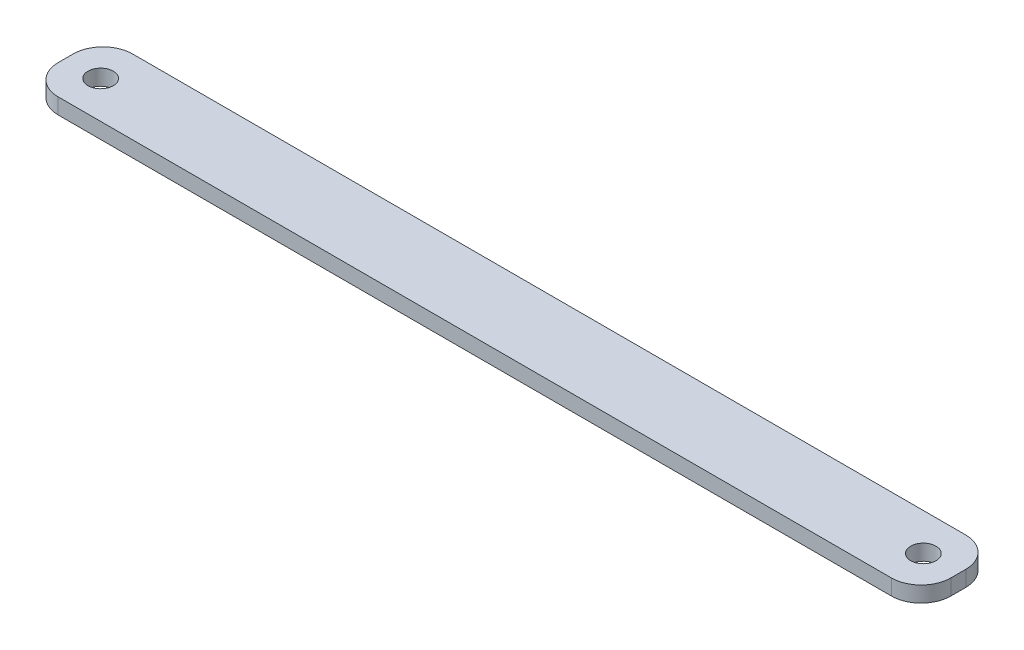
ISO-10303-21;
HEADER;
FILE_DESCRIPTION(('STEP AP214'),'2;1');
FILE_NAME('part.step','',(''),(''),'','','');
FILE_SCHEMA(('AUTOMOTIVE_DESIGN { 1 0 10303 214 1 1 1 1 }'));
ENDSEC;
DATA;
#1=APPLICATION_CONTEXT('core data for automotive mechanical design processes');
#2=APPLICATION_PROTOCOL_DEFINITION('international standard','automotive_design',2000,#1);
#3=PRODUCT_CONTEXT('',#1,'mechanical');
#4=PRODUCT('Part','Part','',(#3));
#5=PRODUCT_RELATED_PRODUCT_CATEGORY('part','',(#4));
#6=PRODUCT_DEFINITION_FORMATION('','',#4);
#7=PRODUCT_DEFINITION_CONTEXT('part definition',#1,'design');
#8=PRODUCT_DEFINITION('design','',#6,#7);
#9=PRODUCT_DEFINITION_SHAPE('','',#8);
#10=(LENGTH_UNIT() NAMED_UNIT(*) SI_UNIT(.MILLI.,.METRE.));
#11=(NAMED_UNIT(*) PLANE_ANGLE_UNIT() SI_UNIT($,.RADIAN.));
#12=(NAMED_UNIT(*) SI_UNIT($,.STERADIAN.) SOLID_ANGLE_UNIT());
#13=UNCERTAINTY_MEASURE_WITH_UNIT(LENGTH_MEASURE(1.E-05),#10,'distance_accuracy_value','');
#14=(GEOMETRIC_REPRESENTATION_CONTEXT(3) GLOBAL_UNCERTAINTY_ASSIGNED_CONTEXT((#13)) GLOBAL_UNIT_ASSIGNED_CONTEXT((#10,
#11,#12)) REPRESENTATION_CONTEXT('',''));
#15=CARTESIAN_POINT('',(0.,0.,0.));
#16=DIRECTION('',(0.,0.,1.));
#17=DIRECTION('',(1.,0.,0.));
#18=AXIS2_PLACEMENT_3D('',#15,#16,#17);
#19=CARTESIAN_POINT('',(0.,2.11,0.));
#20=DIRECTION('',(0.,1.,0.));
#21=DIRECTION('',(0.,0.,1.));
#22=AXIS2_PLACEMENT_3D('',#19,#20,#21);
#23=PLANE('',#22);
#24=CARTESIAN_POINT('',(-55.3,2.11,0.));
#25=DIRECTION('',(0.,1.,0.));
#26=DIRECTION('',(0.,0.,1.));
#27=AXIS2_PLACEMENT_3D('',#24,#25,#26);
#28=CIRCLE('',#27,1.7);
#29=CARTESIAN_POINT('',(-55.3,2.11,1.7));
#30=VERTEX_POINT('',#29);
#31=EDGE_CURVE('E133',#30,#30,#28,.T.);
#32=ORIENTED_EDGE('',*,*,#31,.F.);
#33=EDGE_LOOP('',(#32));
#34=FACE_BOUND('',#33,.T.);
#35=DIRECTION('',(0.,0.,-1.));
#36=VECTOR('',#35,1.);
#37=CARTESIAN_POINT('',(60.,2.11,-5.));
#38=LINE('',#37,#36);
#39=CARTESIAN_POINT('',(60.,2.11,1.));
#40=VERTEX_POINT('',#39);
#41=CARTESIAN_POINT('',(60.,2.11,-0.999999999999997));
#42=VERTEX_POINT('',#41);
#43=EDGE_CURVE('E138',#40,#42,#38,.T.);
#44=ORIENTED_EDGE('',*,*,#43,.T.);
#45=CARTESIAN_POINT('',(56.,2.11,-0.999999999999997));
#46=DIRECTION('',(0.,1.,0.));
#47=DIRECTION('',(0.,0.,1.));
#48=AXIS2_PLACEMENT_3D('',#45,#46,#47);
#49=CIRCLE('',#48,4.);
#50=CARTESIAN_POINT('',(56.,2.11,-5.));
#51=VERTEX_POINT('',#50);
#52=EDGE_CURVE('E152',#42,#51,#49,.T.);
#53=ORIENTED_EDGE('',*,*,#52,.T.);
#54=DIRECTION('',(-1.,0.,0.));
#55=VECTOR('',#54,1.);
#56=CARTESIAN_POINT('',(-60.,2.11,-5.));
#57=LINE('',#56,#55);
#58=CARTESIAN_POINT('',(-56.,2.11,-5.));
#59=VERTEX_POINT('',#58);
#60=EDGE_CURVE('E119',#51,#59,#57,.T.);
#61=ORIENTED_EDGE('',*,*,#60,.T.);
#62=CARTESIAN_POINT('',(-56.,2.11,-0.999999999999997));
#63=DIRECTION('',(0.,1.,0.));
#64=DIRECTION('',(0.,0.,1.));
#65=AXIS2_PLACEMENT_3D('',#62,#63,#64);
#66=CIRCLE('',#65,4.);
#67=CARTESIAN_POINT('',(-60.,2.11,-1.));
#68=VERTEX_POINT('',#67);
#69=EDGE_CURVE('E148',#59,#68,#66,.T.);
#70=ORIENTED_EDGE('',*,*,#69,.T.);
#71=DIRECTION('',(0.,0.,1.));
#72=VECTOR('',#71,1.);
#73=CARTESIAN_POINT('',(-60.,2.11,-5.));
#74=LINE('',#73,#72);
#75=CARTESIAN_POINT('',(-60.,2.11,1.));
#76=VERTEX_POINT('',#75);
#77=EDGE_CURVE('E161',#68,#76,#74,.T.);
#78=ORIENTED_EDGE('',*,*,#77,.T.);
#79=CARTESIAN_POINT('',(-56.,2.11,1.));
#80=DIRECTION('',(0.,1.,0.));
#81=DIRECTION('',(0.,0.,1.));
#82=AXIS2_PLACEMENT_3D('',#79,#80,#81);
#83=CIRCLE('',#82,4.);
#84=CARTESIAN_POINT('',(-56.,2.11,5.));
#85=VERTEX_POINT('',#84);
#86=EDGE_CURVE('E54',#76,#85,#83,.T.);
#87=ORIENTED_EDGE('',*,*,#86,.T.);
#88=DIRECTION('',(1.,0.,0.));
#89=VECTOR('',#88,1.);
#90=CARTESIAN_POINT('',(-60.,2.11,5.));
#91=LINE('',#90,#89);
#92=CARTESIAN_POINT('',(56.,2.11,5.));
#93=VERTEX_POINT('',#92);
#94=EDGE_CURVE('E139',#85,#93,#91,.T.);
#95=ORIENTED_EDGE('',*,*,#94,.T.);
#96=CARTESIAN_POINT('',(56.,2.11,1.));
#97=DIRECTION('',(0.,1.,0.));
#98=DIRECTION('',(0.,0.,1.));
#99=AXIS2_PLACEMENT_3D('',#96,#97,#98);
#100=CIRCLE('',#99,4.);
#101=EDGE_CURVE('E150',#93,#40,#100,.T.);
#102=ORIENTED_EDGE('',*,*,#101,.T.);
#103=EDGE_LOOP('',(#44,#53,#61,#70,#78,#87,#95,#102));
#104=FACE_BOUND('',#103,.T.);
#105=CARTESIAN_POINT('',(55.3,2.11,0.));
#106=DIRECTION('',(0.,1.,0.));
#107=DIRECTION('',(0.,0.,-1.));
#108=AXIS2_PLACEMENT_3D('',#105,#106,#107);
#109=CIRCLE('',#108,1.7);
#110=CARTESIAN_POINT('',(55.3,2.11,-1.7));
#111=VERTEX_POINT('',#110);
#112=EDGE_CURVE('E184',#111,#111,#109,.T.);
#113=ORIENTED_EDGE('',*,*,#112,.F.);
#114=EDGE_LOOP('',(#113));
#115=FACE_BOUND('',#114,.T.);
#116=ADVANCED_FACE('F32',(#34,#104,#115),#23,.T.);
#117=CARTESIAN_POINT('',(0.,0.,0.));
#118=DIRECTION('',(0.,1.,0.));
#119=DIRECTION('',(0.,0.,1.));
#120=AXIS2_PLACEMENT_3D('',#117,#118,#119);
#121=PLANE('',#120);
#122=DIRECTION('',(-1.,0.,0.));
#123=VECTOR('',#122,1.);
#124=CARTESIAN_POINT('',(-60.,0.,-5.));
#125=LINE('',#124,#123);
#126=CARTESIAN_POINT('',(56.,0.,-5.));
#127=VERTEX_POINT('',#126);
#128=CARTESIAN_POINT('',(-56.,0.,-5.));
#129=VERTEX_POINT('',#128);
#130=EDGE_CURVE('E116',#127,#129,#125,.T.);
#131=ORIENTED_EDGE('',*,*,#130,.F.);
#132=CARTESIAN_POINT('',(56.,0.,-0.999999999999997));
#133=DIRECTION('',(0.,1.,0.));
#134=DIRECTION('',(0.,0.,1.));
#135=AXIS2_PLACEMENT_3D('',#132,#133,#134);
#136=CIRCLE('',#135,4.);
#137=CARTESIAN_POINT('',(60.,0.,-0.999999999999997));
#138=VERTEX_POINT('',#137);
#139=EDGE_CURVE('E99',#127,#138,#136,.F.);
#140=ORIENTED_EDGE('',*,*,#139,.T.);
#141=DIRECTION('',(0.,0.,-1.));
#142=VECTOR('',#141,1.);
#143=CARTESIAN_POINT('',(60.,0.,-5.));
#144=LINE('',#143,#142);
#145=CARTESIAN_POINT('',(60.,0.,1.));
#146=VERTEX_POINT('',#145);
#147=EDGE_CURVE('E128',#146,#138,#144,.T.);
#148=ORIENTED_EDGE('',*,*,#147,.F.);
#149=CARTESIAN_POINT('',(56.,0.,1.));
#150=DIRECTION('',(0.,1.,0.));
#151=DIRECTION('',(0.,0.,1.));
#152=AXIS2_PLACEMENT_3D('',#149,#150,#151);
#153=CIRCLE('',#152,4.);
#154=CARTESIAN_POINT('',(56.,0.,5.));
#155=VERTEX_POINT('',#154);
#156=EDGE_CURVE('E110',#146,#155,#153,.F.);
#157=ORIENTED_EDGE('',*,*,#156,.T.);
#158=DIRECTION('',(1.,0.,0.));
#159=VECTOR('',#158,1.);
#160=CARTESIAN_POINT('',(-60.,0.,5.));
#161=LINE('',#160,#159);
#162=CARTESIAN_POINT('',(-56.,0.,5.));
#163=VERTEX_POINT('',#162);
#164=EDGE_CURVE('E131',#163,#155,#161,.T.);
#165=ORIENTED_EDGE('',*,*,#164,.F.);
#166=CARTESIAN_POINT('',(-56.,0.,1.));
#167=DIRECTION('',(0.,1.,0.));
#168=DIRECTION('',(0.,0.,1.));
#169=AXIS2_PLACEMENT_3D('',#166,#167,#168);
#170=CIRCLE('',#169,4.);
#171=CARTESIAN_POINT('',(-60.,0.,1.));
#172=VERTEX_POINT('',#171);
#173=EDGE_CURVE('E120',#163,#172,#170,.F.);
#174=ORIENTED_EDGE('',*,*,#173,.T.);
#175=DIRECTION('',(0.,0.,1.));
#176=VECTOR('',#175,1.);
#177=CARTESIAN_POINT('',(-60.,0.,-5.));
#178=LINE('',#177,#176);
#179=CARTESIAN_POINT('',(-60.,0.,-1.));
#180=VERTEX_POINT('',#179);
#181=EDGE_CURVE('E127',#180,#172,#178,.T.);
#182=ORIENTED_EDGE('',*,*,#181,.F.);
#183=CARTESIAN_POINT('',(-56.,0.,-0.999999999999997));
#184=DIRECTION('',(0.,1.,0.));
#185=DIRECTION('',(0.,0.,1.));
#186=AXIS2_PLACEMENT_3D('',#183,#184,#185);
#187=CIRCLE('',#186,4.);
#188=EDGE_CURVE('E126',#180,#129,#187,.F.);
#189=ORIENTED_EDGE('',*,*,#188,.T.);
#190=EDGE_LOOP('',(#131,#140,#148,#157,#165,#174,#182,#189));
#191=FACE_BOUND('',#190,.T.);
#192=CARTESIAN_POINT('',(-55.3,0.,0.));
#193=DIRECTION('',(0.,1.,0.));
#194=DIRECTION('',(0.,0.,1.));
#195=AXIS2_PLACEMENT_3D('',#192,#193,#194);
#196=CIRCLE('',#195,1.7);
#197=CARTESIAN_POINT('',(-55.3,0.,1.7));
#198=VERTEX_POINT('',#197);
#199=EDGE_CURVE('E181',#198,#198,#196,.T.);
#200=ORIENTED_EDGE('',*,*,#199,.T.);
#201=EDGE_LOOP('',(#200));
#202=FACE_BOUND('',#201,.T.);
#203=CARTESIAN_POINT('',(55.3,0.,0.));
#204=DIRECTION('',(0.,1.,0.));
#205=DIRECTION('',(0.,0.,-1.));
#206=AXIS2_PLACEMENT_3D('',#203,#204,#205);
#207=CIRCLE('',#206,1.7);
#208=CARTESIAN_POINT('',(55.3,0.,-1.7));
#209=VERTEX_POINT('',#208);
#210=EDGE_CURVE('E187',#209,#209,#207,.T.);
#211=ORIENTED_EDGE('',*,*,#210,.T.);
#212=EDGE_LOOP('',(#211));
#213=FACE_BOUND('',#212,.T.);
#214=ADVANCED_FACE('F123',(#191,#202,#213),#121,.F.);
#215=CARTESIAN_POINT('',(60.,2.11,-5.));
#216=DIRECTION('',(-1.,0.,0.));
#217=DIRECTION('',(0.,0.,1.));
#218=AXIS2_PLACEMENT_3D('',#215,#216,#217);
#219=PLANE('',#218);
#220=ORIENTED_EDGE('',*,*,#147,.T.);
#221=DIRECTION('',(0.,-1.,0.));
#222=VECTOR('',#221,1.);
#223=CARTESIAN_POINT('',(60.,2.11,-0.999999999999997));
#224=LINE('',#223,#222);
#225=EDGE_CURVE('E104',#138,#42,#224,.F.);
#226=ORIENTED_EDGE('',*,*,#225,.T.);
#227=ORIENTED_EDGE('',*,*,#43,.F.);
#228=DIRECTION('',(0.,-1.,0.));
#229=VECTOR('',#228,1.);
#230=CARTESIAN_POINT('',(60.,2.11,1.));
#231=LINE('',#230,#229);
#232=EDGE_CURVE('E109',#40,#146,#231,.T.);
#233=ORIENTED_EDGE('',*,*,#232,.T.);
#234=EDGE_LOOP('',(#220,#226,#227,#233));
#235=FACE_BOUND('',#234,.T.);
#236=ADVANCED_FACE('F177',(#235),#219,.F.);
#237=CARTESIAN_POINT('',(-60.,2.11,-5.));
#238=DIRECTION('',(0.,0.,1.));
#239=DIRECTION('',(1.,0.,0.));
#240=AXIS2_PLACEMENT_3D('',#237,#238,#239);
#241=PLANE('',#240);
#242=ORIENTED_EDGE('',*,*,#60,.F.);
#243=DIRECTION('',(0.,-1.,0.));
#244=VECTOR('',#243,1.);
#245=CARTESIAN_POINT('',(56.,2.11,-5.));
#246=LINE('',#245,#244);
#247=EDGE_CURVE('E103',#51,#127,#246,.T.);
#248=ORIENTED_EDGE('',*,*,#247,.T.);
#249=ORIENTED_EDGE('',*,*,#130,.T.);
#250=DIRECTION('',(0.,-1.,0.));
#251=VECTOR('',#250,1.);
#252=CARTESIAN_POINT('',(-56.,2.11,-5.));
#253=LINE('',#252,#251);
#254=EDGE_CURVE('E121',#129,#59,#253,.F.);
#255=ORIENTED_EDGE('',*,*,#254,.T.);
#256=EDGE_LOOP('',(#242,#248,#249,#255));
#257=FACE_BOUND('',#256,.T.);
#258=ADVANCED_FACE('F115',(#257),#241,.F.);
#259=CARTESIAN_POINT('',(-60.,2.11,-5.));
#260=DIRECTION('',(1.,0.,0.));
#261=DIRECTION('',(0.,0.,-1.));
#262=AXIS2_PLACEMENT_3D('',#259,#260,#261);
#263=PLANE('',#262);
#264=ORIENTED_EDGE('',*,*,#77,.F.);
#265=DIRECTION('',(0.,-1.,0.));
#266=VECTOR('',#265,1.);
#267=CARTESIAN_POINT('',(-60.,2.11,-1.));
#268=LINE('',#267,#266);
#269=EDGE_CURVE('E11',#68,#180,#268,.T.);
#270=ORIENTED_EDGE('',*,*,#269,.T.);
#271=ORIENTED_EDGE('',*,*,#181,.T.);
#272=DIRECTION('',(0.,-1.,0.));
#273=VECTOR('',#272,1.);
#274=CARTESIAN_POINT('',(-60.,2.11,1.));
#275=LINE('',#274,#273);
#276=EDGE_CURVE('E40',#172,#76,#275,.F.);
#277=ORIENTED_EDGE('',*,*,#276,.T.);
#278=EDGE_LOOP('',(#264,#270,#271,#277));
#279=FACE_BOUND('',#278,.T.);
#280=ADVANCED_FACE('F160',(#279),#263,.F.);
#281=CARTESIAN_POINT('',(-60.,2.11,5.));
#282=DIRECTION('',(0.,0.,-1.));
#283=DIRECTION('',(-1.,0.,0.));
#284=AXIS2_PLACEMENT_3D('',#281,#282,#283);
#285=PLANE('',#284);
#286=ORIENTED_EDGE('',*,*,#164,.T.);
#287=DIRECTION('',(0.,-1.,0.));
#288=VECTOR('',#287,1.);
#289=CARTESIAN_POINT('',(56.,2.11,5.));
#290=LINE('',#289,#288);
#291=EDGE_CURVE('E47',#155,#93,#290,.F.);
#292=ORIENTED_EDGE('',*,*,#291,.T.);
#293=ORIENTED_EDGE('',*,*,#94,.F.);
#294=DIRECTION('',(0.,-1.,0.));
#295=VECTOR('',#294,1.);
#296=CARTESIAN_POINT('',(-56.,2.11,5.));
#297=LINE('',#296,#295);
#298=EDGE_CURVE('E154',#85,#163,#297,.T.);
#299=ORIENTED_EDGE('',*,*,#298,.T.);
#300=EDGE_LOOP('',(#286,#292,#293,#299));
#301=FACE_BOUND('',#300,.T.);
#302=ADVANCED_FACE('F170',(#301),#285,.F.);
#303=CARTESIAN_POINT('',(-55.3,2.11,0.));
#304=DIRECTION('',(0.,-1.,0.));
#305=DIRECTION('',(0.,0.,-1.));
#306=AXIS2_PLACEMENT_3D('',#303,#304,#305);
#307=CYLINDRICAL_SURFACE('',#306,1.7);
#308=ORIENTED_EDGE('',*,*,#31,.T.);
#309=EDGE_LOOP('',(#308));
#310=FACE_BOUND('',#309,.T.);
#311=ORIENTED_EDGE('',*,*,#199,.F.);
#312=EDGE_LOOP('',(#311));
#313=FACE_BOUND('',#312,.T.);
#314=ADVANCED_FACE('F204',(#310,#313),#307,.F.);
#315=CARTESIAN_POINT('',(55.3,2.11,0.));
#316=DIRECTION('',(0.,-1.,0.));
#317=DIRECTION('',(0.,0.,-1.));
#318=AXIS2_PLACEMENT_3D('',#315,#316,#317);
#319=CYLINDRICAL_SURFACE('',#318,1.7);
#320=ORIENTED_EDGE('',*,*,#112,.T.);
#321=EDGE_LOOP('',(#320));
#322=FACE_BOUND('',#321,.T.);
#323=ORIENTED_EDGE('',*,*,#210,.F.);
#324=EDGE_LOOP('',(#323));
#325=FACE_BOUND('',#324,.T.);
#326=ADVANCED_FACE('F193',(#322,#325),#319,.F.);
#327=CARTESIAN_POINT('',(56.,2.11,-0.999999999999997));
#328=DIRECTION('',(0.,-1.,0.));
#329=DIRECTION('',(0.,0.,-1.));
#330=AXIS2_PLACEMENT_3D('',#327,#328,#329);
#331=CYLINDRICAL_SURFACE('',#330,4.);
#332=ORIENTED_EDGE('',*,*,#52,.F.);
#333=ORIENTED_EDGE('',*,*,#225,.F.);
#334=ORIENTED_EDGE('',*,*,#139,.F.);
#335=ORIENTED_EDGE('',*,*,#247,.F.);
#336=EDGE_LOOP('',(#332,#333,#334,#335));
#337=FACE_BOUND('',#336,.T.);
#338=ADVANCED_FACE('F102',(#337),#331,.T.);
#339=CARTESIAN_POINT('',(56.,2.11,1.));
#340=DIRECTION('',(0.,-1.,0.));
#341=DIRECTION('',(0.,0.,-1.));
#342=AXIS2_PLACEMENT_3D('',#339,#340,#341);
#343=CYLINDRICAL_SURFACE('',#342,4.);
#344=ORIENTED_EDGE('',*,*,#101,.F.);
#345=ORIENTED_EDGE('',*,*,#291,.F.);
#346=ORIENTED_EDGE('',*,*,#156,.F.);
#347=ORIENTED_EDGE('',*,*,#232,.F.);
#348=EDGE_LOOP('',(#344,#345,#346,#347));
#349=FACE_BOUND('',#348,.T.);
#350=ADVANCED_FACE('F174',(#349),#343,.T.);
#351=CARTESIAN_POINT('',(-56.,2.11,-0.999999999999997));
#352=DIRECTION('',(0.,-1.,0.));
#353=DIRECTION('',(0.,0.,-1.));
#354=AXIS2_PLACEMENT_3D('',#351,#352,#353);
#355=CYLINDRICAL_SURFACE('',#354,4.);
#356=ORIENTED_EDGE('',*,*,#69,.F.);
#357=ORIENTED_EDGE('',*,*,#254,.F.);
#358=ORIENTED_EDGE('',*,*,#188,.F.);
#359=ORIENTED_EDGE('',*,*,#269,.F.);
#360=EDGE_LOOP('',(#356,#357,#358,#359));
#361=FACE_BOUND('',#360,.T.);
#362=ADVANCED_FACE('F218',(#361),#355,.T.);
#363=CARTESIAN_POINT('',(-56.,2.11,1.));
#364=DIRECTION('',(0.,-1.,0.));
#365=DIRECTION('',(0.,0.,-1.));
#366=AXIS2_PLACEMENT_3D('',#363,#364,#365);
#367=CYLINDRICAL_SURFACE('',#366,4.);
#368=ORIENTED_EDGE('',*,*,#86,.F.);
#369=ORIENTED_EDGE('',*,*,#276,.F.);
#370=ORIENTED_EDGE('',*,*,#173,.F.);
#371=ORIENTED_EDGE('',*,*,#298,.F.);
#372=EDGE_LOOP('',(#368,#369,#370,#371));
#373=FACE_BOUND('',#372,.T.);
#374=ADVANCED_FACE('F34',(#373),#367,.T.);
#375=CLOSED_SHELL('',(#116,#214,#236,#258,#280,#302,#314,#326,#338,#350,#362,#374));
#376=MANIFOLD_SOLID_BREP('B2',#375);
#377=ADVANCED_BREP_SHAPE_REPRESENTATION('',(#18,#376),#14);
#378=SHAPE_DEFINITION_REPRESENTATION(#9,#377);
ENDSEC;
END-ISO-10303-21;
